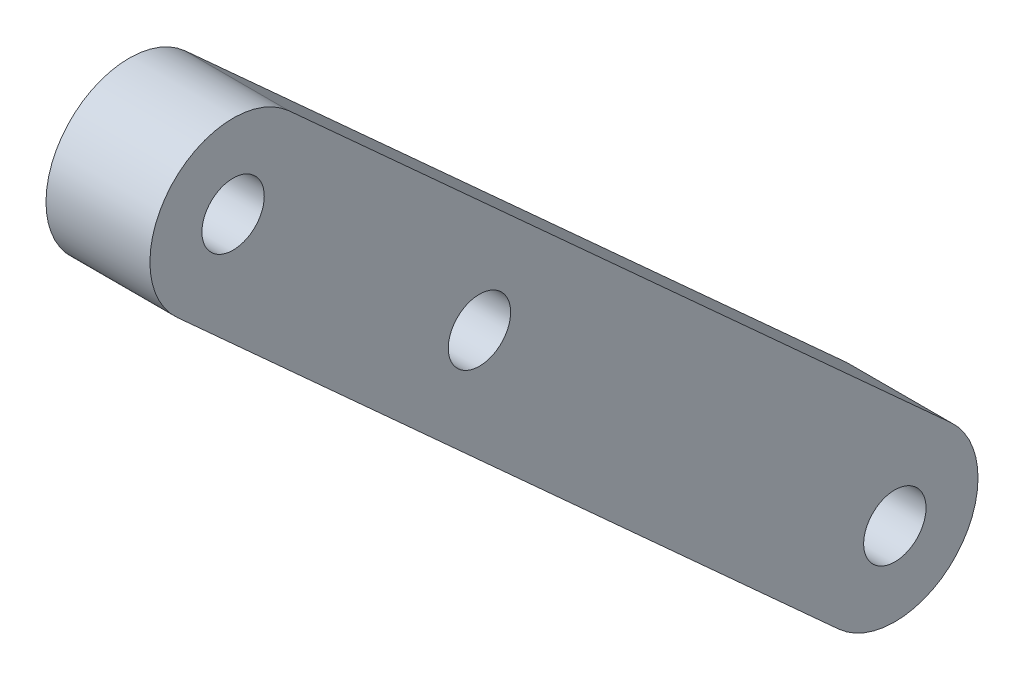
ISO-10303-21;
HEADER;
FILE_DESCRIPTION(('STEP AP214'),'2;1');
FILE_NAME('part.step','',(''),(''),'','','');
FILE_SCHEMA(('AUTOMOTIVE_DESIGN { 1 0 10303 214 1 1 1 1 }'));
ENDSEC;
DATA;
#1=APPLICATION_CONTEXT('core data for automotive mechanical design processes');
#2=APPLICATION_PROTOCOL_DEFINITION('international standard','automotive_design',2000,#1);
#3=PRODUCT_CONTEXT('',#1,'mechanical');
#4=PRODUCT('Part','Part','',(#3));
#5=PRODUCT_RELATED_PRODUCT_CATEGORY('part','',(#4));
#6=PRODUCT_DEFINITION_FORMATION('','',#4);
#7=PRODUCT_DEFINITION_CONTEXT('part definition',#1,'design');
#8=PRODUCT_DEFINITION('design','',#6,#7);
#9=PRODUCT_DEFINITION_SHAPE('','',#8);
#10=(LENGTH_UNIT() NAMED_UNIT(*) SI_UNIT(.MILLI.,.METRE.));
#11=(NAMED_UNIT(*) PLANE_ANGLE_UNIT() SI_UNIT($,.RADIAN.));
#12=(NAMED_UNIT(*) SI_UNIT($,.STERADIAN.) SOLID_ANGLE_UNIT());
#13=UNCERTAINTY_MEASURE_WITH_UNIT(LENGTH_MEASURE(1.E-05),#10,'distance_accuracy_value','');
#14=(GEOMETRIC_REPRESENTATION_CONTEXT(3) GLOBAL_UNCERTAINTY_ASSIGNED_CONTEXT((#13)) GLOBAL_UNIT_ASSIGNED_CONTEXT((#10,
#11,#12)) REPRESENTATION_CONTEXT('',''));
#15=CARTESIAN_POINT('',(0.,0.,0.));
#16=DIRECTION('',(0.,0.,1.));
#17=DIRECTION('',(1.,0.,0.));
#18=AXIS2_PLACEMENT_3D('',#15,#16,#17);
#19=CARTESIAN_POINT('',(5.,64.468002936532,-58.5328534598354));
#20=DIRECTION('',(0.,0.740365331063235,-0.672204713282811));
#21=DIRECTION('',(0.,0.672204713282811,0.740365331063235));
#22=AXIS2_PLACEMENT_3D('',#19,#20,#21);
#23=PLANE('',#22);
#24=DIRECTION('',(0.,-0.672204713282811,-0.740365331063235));
#25=VECTOR('',#24,1.);
#26=CARTESIAN_POINT('',(0.,64.468002936532,-58.5328534598354));
#27=LINE('',#26,#25);
#28=CARTESIAN_POINT('',(0.,62.6667431165,-60.5167585063742));
#29=VERTEX_POINT('',#28);
#30=CARTESIAN_POINT('',(0.,33.7619404453392,-92.3524677420933));
#31=VERTEX_POINT('',#30);
#32=EDGE_CURVE('E131',#29,#31,#27,.T.);
#33=ORIENTED_EDGE('',*,*,#32,.F.);
#34=DIRECTION('',(-1.,0.,0.));
#35=VECTOR('',#34,1.);
#36=CARTESIAN_POINT('',(5.,62.6667431165,-60.5167585063742));
#37=LINE('',#36,#35);
#38=CARTESIAN_POINT('',(5.,62.6667431165,-60.5167585063742));
#39=VERTEX_POINT('',#38);
#40=EDGE_CURVE('E11',#39,#29,#37,.T.);
#41=ORIENTED_EDGE('',*,*,#40,.F.);
#42=DIRECTION('',(0.,-0.672204713282811,-0.740365331063235));
#43=VECTOR('',#42,1.);
#44=CARTESIAN_POINT('',(5.,64.468002936532,-58.5328534598354));
#45=LINE('',#44,#43);
#46=CARTESIAN_POINT('',(5.,33.7619404453392,-92.3524677420933));
#47=VERTEX_POINT('',#46);
#48=EDGE_CURVE('E101',#39,#47,#45,.T.);
#49=ORIENTED_EDGE('',*,*,#48,.T.);
#50=DIRECTION('',(-1.,0.,0.));
#51=VECTOR('',#50,1.);
#52=CARTESIAN_POINT('',(5.,33.7619404453392,-92.3524677420933));
#53=LINE('',#52,#51);
#54=EDGE_CURVE('E81',#47,#31,#53,.T.);
#55=ORIENTED_EDGE('',*,*,#54,.T.);
#56=EDGE_LOOP('',(#33,#41,#49,#55));
#57=FACE_BOUND('',#56,.T.);
#58=ADVANCED_FACE('F41',(#57),#23,.T.);
#59=CARTESIAN_POINT('',(5.,59.7052817922471,-57.8279396532429));
#60=DIRECTION('',(-1.,0.,0.));
#61=DIRECTION('',(0.,0.,1.));
#62=AXIS2_PLACEMENT_3D('',#59,#60,#61);
#63=CYLINDRICAL_SURFACE('',#62,4.00000000000001);
#64=CARTESIAN_POINT('',(0.,59.7052817922471,-57.8279396532429));
#65=DIRECTION('',(1.,0.,0.));
#66=DIRECTION('',(0.,0.,-1.));
#67=AXIS2_PLACEMENT_3D('',#64,#65,#66);
#68=CIRCLE('',#67,4.00000000000001);
#69=CARTESIAN_POINT('',(0.,56.7438204679941,-55.1391208001117));
#70=VERTEX_POINT('',#69);
#71=EDGE_CURVE('E107',#29,#70,#68,.T.);
#72=ORIENTED_EDGE('',*,*,#71,.T.);
#73=DIRECTION('',(-1.,0.,0.));
#74=VECTOR('',#73,1.);
#75=CARTESIAN_POINT('',(5.,56.7438204679941,-55.1391208001117));
#76=LINE('',#75,#74);
#77=CARTESIAN_POINT('',(5.,56.7438204679941,-55.1391208001117));
#78=VERTEX_POINT('',#77);
#79=EDGE_CURVE('E51',#78,#70,#76,.T.);
#80=ORIENTED_EDGE('',*,*,#79,.F.);
#81=CARTESIAN_POINT('',(5.,59.7052817922471,-57.8279396532429));
#82=DIRECTION('',(1.,0.,0.));
#83=DIRECTION('',(0.,0.,-1.));
#84=AXIS2_PLACEMENT_3D('',#81,#82,#83);
#85=CIRCLE('',#84,4.00000000000001);
#86=EDGE_CURVE('E97',#39,#78,#85,.T.);
#87=ORIENTED_EDGE('',*,*,#86,.F.);
#88=ORIENTED_EDGE('',*,*,#40,.T.);
#89=EDGE_LOOP('',(#72,#80,#87,#88));
#90=FACE_BOUND('',#89,.T.);
#91=ADVANCED_FACE('F105',(#90),#63,.T.);
#92=CARTESIAN_POINT('',(5.,58.5450802880261,-53.1552157535729));
#93=DIRECTION('',(0.,0.740365331063236,-0.672204713282811));
#94=DIRECTION('',(0.,0.672204713282811,0.740365331063236));
#95=AXIS2_PLACEMENT_3D('',#92,#93,#94);
#96=PLANE('',#95);
#97=DIRECTION('',(0.,-0.672204713282811,-0.740365331063236));
#98=VECTOR('',#97,1.);
#99=CARTESIAN_POINT('',(0.,58.5450802880261,-53.1552157535729));
#100=LINE('',#99,#98);
#101=CARTESIAN_POINT('',(0.,27.8390177968333,-86.9748300358308));
#102=VERTEX_POINT('',#101);
#103=EDGE_CURVE('E126',#70,#102,#100,.T.);
#104=ORIENTED_EDGE('',*,*,#103,.T.);
#105=DIRECTION('',(-1.,0.,0.));
#106=VECTOR('',#105,1.);
#107=CARTESIAN_POINT('',(5.,27.8390177968333,-86.9748300358308));
#108=LINE('',#107,#106);
#109=CARTESIAN_POINT('',(5.,27.8390177968333,-86.9748300358308));
#110=VERTEX_POINT('',#109);
#111=EDGE_CURVE('E95',#110,#102,#108,.T.);
#112=ORIENTED_EDGE('',*,*,#111,.F.);
#113=DIRECTION('',(0.,-0.672204713282811,-0.740365331063236));
#114=VECTOR('',#113,1.);
#115=CARTESIAN_POINT('',(5.,58.5450802880261,-53.1552157535729));
#116=LINE('',#115,#114);
#117=EDGE_CURVE('E89',#78,#110,#116,.T.);
#118=ORIENTED_EDGE('',*,*,#117,.F.);
#119=ORIENTED_EDGE('',*,*,#79,.T.);
#120=EDGE_LOOP('',(#104,#112,#118,#119));
#121=FACE_BOUND('',#120,.T.);
#122=ADVANCED_FACE('F92',(#121),#96,.F.);
#123=CARTESIAN_POINT('',(5.,30.8004791210862,-89.6636488889621));
#124=DIRECTION('',(-1.,0.,0.));
#125=DIRECTION('',(0.,0.,1.));
#126=AXIS2_PLACEMENT_3D('',#123,#124,#125);
#127=CYLINDRICAL_SURFACE('',#126,1.5);
#128=CARTESIAN_POINT('',(5.,30.8004791210862,-89.6636488889621));
#129=DIRECTION('',(1.,0.,0.));
#130=DIRECTION('',(0.,0.,-1.));
#131=AXIS2_PLACEMENT_3D('',#128,#129,#130);
#132=CIRCLE('',#131,1.5);
#133=CARTESIAN_POINT('',(5.,30.8004791210862,-91.1636488889621));
#134=VERTEX_POINT('',#133);
#135=EDGE_CURVE('E141',#134,#134,#132,.T.);
#136=ORIENTED_EDGE('',*,*,#135,.T.);
#137=EDGE_LOOP('',(#136));
#138=FACE_BOUND('',#137,.T.);
#139=CARTESIAN_POINT('',(0.,30.8004791210862,-89.6636488889621));
#140=DIRECTION('',(1.,0.,0.));
#141=DIRECTION('',(0.,0.,-1.));
#142=AXIS2_PLACEMENT_3D('',#139,#140,#141);
#143=CIRCLE('',#142,1.5);
#144=CARTESIAN_POINT('',(0.,30.8004791210862,-91.1636488889621));
#145=VERTEX_POINT('',#144);
#146=EDGE_CURVE('E120',#145,#145,#143,.T.);
#147=ORIENTED_EDGE('',*,*,#146,.F.);
#148=EDGE_LOOP('',(#147));
#149=FACE_BOUND('',#148,.T.);
#150=ADVANCED_FACE('F175',(#138,#149),#127,.F.);
#151=CARTESIAN_POINT('',(5.,30.8004791210862,-89.6636488889621));
#152=DIRECTION('',(-1.,0.,0.));
#153=DIRECTION('',(0.,0.,1.));
#154=AXIS2_PLACEMENT_3D('',#151,#152,#153);
#155=CYLINDRICAL_SURFACE('',#154,4.00000000000001);
#156=CARTESIAN_POINT('',(0.,30.8004791210862,-89.6636488889621));
#157=DIRECTION('',(1.,0.,0.));
#158=DIRECTION('',(0.,0.,-1.));
#159=AXIS2_PLACEMENT_3D('',#156,#157,#158);
#160=CIRCLE('',#159,4.00000000000001);
#161=EDGE_CURVE('E74',#102,#31,#160,.T.);
#162=ORIENTED_EDGE('',*,*,#161,.T.);
#163=ORIENTED_EDGE('',*,*,#54,.F.);
#164=CARTESIAN_POINT('',(5.,30.8004791210862,-89.6636488889621));
#165=DIRECTION('',(1.,0.,0.));
#166=DIRECTION('',(0.,0.,-1.));
#167=AXIS2_PLACEMENT_3D('',#164,#165,#166);
#168=CIRCLE('',#167,4.00000000000001);
#169=EDGE_CURVE('E59',#110,#47,#168,.T.);
#170=ORIENTED_EDGE('',*,*,#169,.F.);
#171=ORIENTED_EDGE('',*,*,#111,.T.);
#172=EDGE_LOOP('',(#162,#163,#170,#171));
#173=FACE_BOUND('',#172,.T.);
#174=ADVANCED_FACE('F176',(#173),#155,.T.);
#175=CARTESIAN_POINT('',(5.,48.9449544678111,-69.6793491189679));
#176=DIRECTION('',(-1.,0.,0.));
#177=DIRECTION('',(0.,0.,1.));
#178=AXIS2_PLACEMENT_3D('',#175,#176,#177);
#179=CYLINDRICAL_SURFACE('',#178,1.5);
#180=CARTESIAN_POINT('',(5.,48.9449544678111,-69.6793491189679));
#181=DIRECTION('',(1.,0.,0.));
#182=DIRECTION('',(0.,0.,-1.));
#183=AXIS2_PLACEMENT_3D('',#180,#181,#182);
#184=CIRCLE('',#183,1.5);
#185=CARTESIAN_POINT('',(5.,48.9449544678111,-71.1793491189679));
#186=VERTEX_POINT('',#185);
#187=EDGE_CURVE('E119',#186,#186,#184,.T.);
#188=ORIENTED_EDGE('',*,*,#187,.T.);
#189=EDGE_LOOP('',(#188));
#190=FACE_BOUND('',#189,.T.);
#191=CARTESIAN_POINT('',(0.,48.9449544678111,-69.6793491189679));
#192=DIRECTION('',(1.,0.,0.));
#193=DIRECTION('',(0.,0.,-1.));
#194=AXIS2_PLACEMENT_3D('',#191,#192,#193);
#195=CIRCLE('',#194,1.5);
#196=CARTESIAN_POINT('',(0.,48.9449544678111,-71.1793491189679));
#197=VERTEX_POINT('',#196);
#198=EDGE_CURVE('E134',#197,#197,#195,.T.);
#199=ORIENTED_EDGE('',*,*,#198,.F.);
#200=EDGE_LOOP('',(#199));
#201=FACE_BOUND('',#200,.T.);
#202=ADVANCED_FACE('F43',(#190,#201),#179,.F.);
#203=CARTESIAN_POINT('',(5.,59.7052817922471,-57.8279396532429));
#204=DIRECTION('',(-1.,0.,0.));
#205=DIRECTION('',(0.,0.,1.));
#206=AXIS2_PLACEMENT_3D('',#203,#204,#205);
#207=CYLINDRICAL_SURFACE('',#206,1.5);
#208=CARTESIAN_POINT('',(5.,59.7052817922471,-57.8279396532429));
#209=DIRECTION('',(1.,0.,0.));
#210=DIRECTION('',(0.,0.,-1.));
#211=AXIS2_PLACEMENT_3D('',#208,#209,#210);
#212=CIRCLE('',#211,1.5);
#213=CARTESIAN_POINT('',(5.,59.7052817922471,-59.3279396532429));
#214=VERTEX_POINT('',#213);
#215=EDGE_CURVE('E114',#214,#214,#212,.T.);
#216=ORIENTED_EDGE('',*,*,#215,.T.);
#217=EDGE_LOOP('',(#216));
#218=FACE_BOUND('',#217,.T.);
#219=CARTESIAN_POINT('',(0.,59.7052817922471,-57.8279396532429));
#220=DIRECTION('',(1.,0.,0.));
#221=DIRECTION('',(0.,0.,-1.));
#222=AXIS2_PLACEMENT_3D('',#219,#220,#221);
#223=CIRCLE('',#222,1.5);
#224=CARTESIAN_POINT('',(0.,59.7052817922471,-59.3279396532429));
#225=VERTEX_POINT('',#224);
#226=EDGE_CURVE('E115',#225,#225,#223,.T.);
#227=ORIENTED_EDGE('',*,*,#226,.F.);
#228=EDGE_LOOP('',(#227));
#229=FACE_BOUND('',#228,.T.);
#230=ADVANCED_FACE('F157',(#218,#229),#207,.F.);
#231=CARTESIAN_POINT('',(5.,0.,0.));
#232=DIRECTION('',(1.,0.,0.));
#233=DIRECTION('',(0.,0.,-1.));
#234=AXIS2_PLACEMENT_3D('',#231,#232,#233);
#235=PLANE('',#234);
#236=ORIENTED_EDGE('',*,*,#187,.F.);
#237=EDGE_LOOP('',(#236));
#238=FACE_BOUND('',#237,.T.);
#239=ORIENTED_EDGE('',*,*,#48,.F.);
#240=ORIENTED_EDGE('',*,*,#86,.T.);
#241=ORIENTED_EDGE('',*,*,#117,.T.);
#242=ORIENTED_EDGE('',*,*,#169,.T.);
#243=EDGE_LOOP('',(#239,#240,#241,#242));
#244=FACE_BOUND('',#243,.T.);
#245=ORIENTED_EDGE('',*,*,#135,.F.);
#246=EDGE_LOOP('',(#245));
#247=FACE_BOUND('',#246,.T.);
#248=ORIENTED_EDGE('',*,*,#215,.F.);
#249=EDGE_LOOP('',(#248));
#250=FACE_BOUND('',#249,.T.);
#251=ADVANCED_FACE('F99',(#238,#244,#247,#250),#235,.T.);
#252=CARTESIAN_POINT('',(0.,0.,0.));
#253=DIRECTION('',(1.,0.,0.));
#254=DIRECTION('',(0.,0.,-1.));
#255=AXIS2_PLACEMENT_3D('',#252,#253,#254);
#256=PLANE('',#255);
#257=ORIENTED_EDGE('',*,*,#198,.T.);
#258=EDGE_LOOP('',(#257));
#259=FACE_BOUND('',#258,.T.);
#260=ORIENTED_EDGE('',*,*,#32,.T.);
#261=ORIENTED_EDGE('',*,*,#161,.F.);
#262=ORIENTED_EDGE('',*,*,#103,.F.);
#263=ORIENTED_EDGE('',*,*,#71,.F.);
#264=EDGE_LOOP('',(#260,#261,#262,#263));
#265=FACE_BOUND('',#264,.T.);
#266=ORIENTED_EDGE('',*,*,#146,.T.);
#267=EDGE_LOOP('',(#266));
#268=FACE_BOUND('',#267,.T.);
#269=ORIENTED_EDGE('',*,*,#226,.T.);
#270=EDGE_LOOP('',(#269));
#271=FACE_BOUND('',#270,.T.);
#272=ADVANCED_FACE('F156',(#259,#265,#268,#271),#256,.F.);
#273=CLOSED_SHELL('',(#58,#91,#122,#150,#174,#202,#230,#251,#272));
#274=MANIFOLD_SOLID_BREP('B2',#273);
#275=ADVANCED_BREP_SHAPE_REPRESENTATION('',(#18,#274),#14);
#276=SHAPE_DEFINITION_REPRESENTATION(#9,#275);
ENDSEC;
END-ISO-10303-21;
